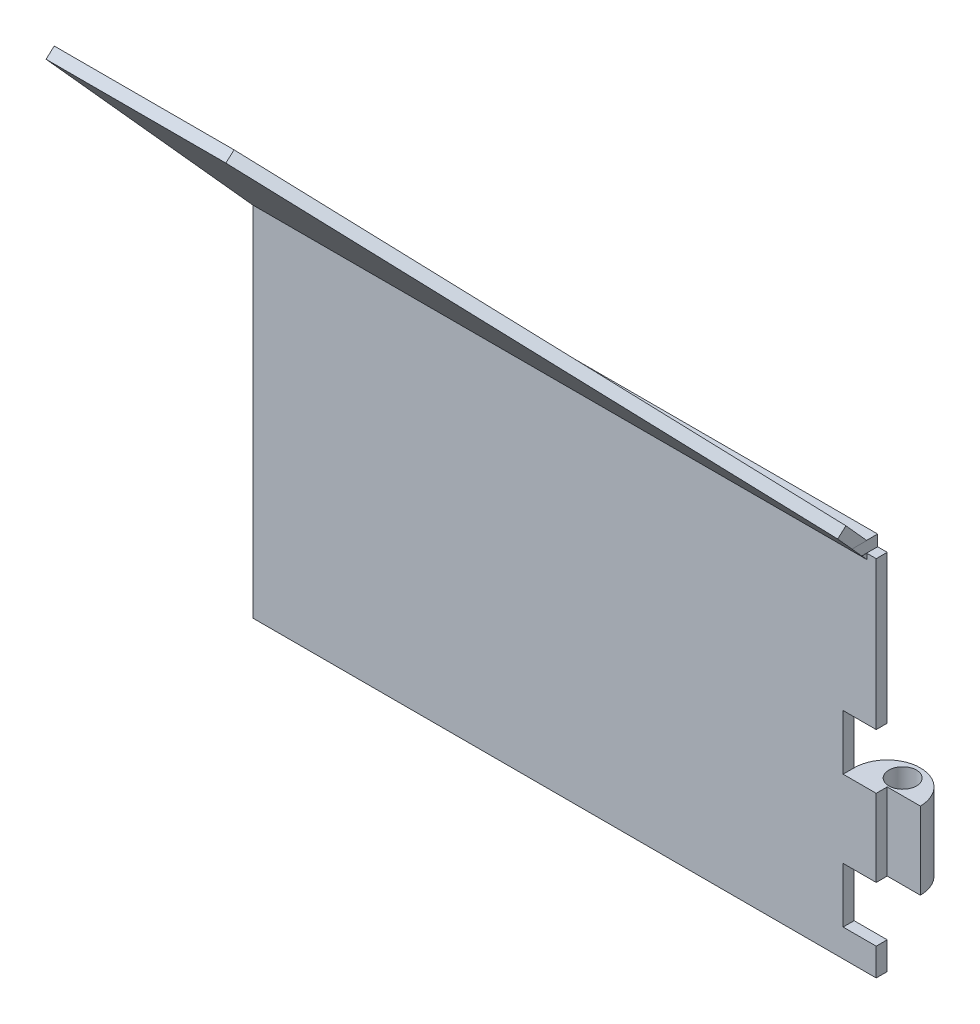
ISO-10303-21;
HEADER;
FILE_DESCRIPTION(('STEP AP214'),'2;1');
FILE_NAME('part.step','',(''),(''),'','','');
FILE_SCHEMA(('AUTOMOTIVE_DESIGN { 1 0 10303 214 1 1 1 1 }'));
ENDSEC;
DATA;
#1=APPLICATION_CONTEXT('core data for automotive mechanical design processes');
#2=APPLICATION_PROTOCOL_DEFINITION('international standard','automotive_design',2000,#1);
#3=PRODUCT_CONTEXT('',#1,'mechanical');
#4=PRODUCT('Part','Part','',(#3));
#5=PRODUCT_RELATED_PRODUCT_CATEGORY('part','',(#4));
#6=PRODUCT_DEFINITION_FORMATION('','',#4);
#7=PRODUCT_DEFINITION_CONTEXT('part definition',#1,'design');
#8=PRODUCT_DEFINITION('design','',#6,#7);
#9=PRODUCT_DEFINITION_SHAPE('','',#8);
#10=(LENGTH_UNIT() NAMED_UNIT(*) SI_UNIT(.MILLI.,.METRE.));
#11=(NAMED_UNIT(*) PLANE_ANGLE_UNIT() SI_UNIT($,.RADIAN.));
#12=(NAMED_UNIT(*) SI_UNIT($,.STERADIAN.) SOLID_ANGLE_UNIT());
#13=UNCERTAINTY_MEASURE_WITH_UNIT(LENGTH_MEASURE(1.E-05),#10,'distance_accuracy_value','');
#14=(GEOMETRIC_REPRESENTATION_CONTEXT(3) GLOBAL_UNCERTAINTY_ASSIGNED_CONTEXT((#13)) GLOBAL_UNIT_ASSIGNED_CONTEXT((#10,
#11,#12)) REPRESENTATION_CONTEXT('',''));
#15=CARTESIAN_POINT('',(0.,0.,0.));
#16=DIRECTION('',(0.,0.,1.));
#17=DIRECTION('',(1.,0.,0.));
#18=AXIS2_PLACEMENT_3D('',#15,#16,#17);
#19=CARTESIAN_POINT('',(0.,0.,1.));
#20=DIRECTION('',(0.,0.,1.));
#21=DIRECTION('',(1.,0.,0.));
#22=AXIS2_PLACEMENT_3D('',#19,#20,#21);
#23=PLANE('',#22);
#24=DIRECTION('',(0.,1.,0.));
#25=VECTOR('',#24,1.);
#26=CARTESIAN_POINT('',(28.25,2.53999999999999,1.));
#27=LINE('',#26,#25);
#28=CARTESIAN_POINT('',(28.25,2.53999999999999,1.));
#29=VERTEX_POINT('',#28);
#30=CARTESIAN_POINT('',(28.25,15.96,1.));
#31=VERTEX_POINT('',#30);
#32=EDGE_CURVE('E265',#29,#31,#27,.T.);
#33=ORIENTED_EDGE('',*,*,#32,.T.);
#34=DIRECTION('',(-1.,0.,0.));
#35=VECTOR('',#34,1.);
#36=CARTESIAN_POINT('',(0.,15.96,1.));
#37=LINE('',#36,#35);
#38=CARTESIAN_POINT('',(27.4,15.96,1.));
#39=VERTEX_POINT('',#38);
#40=EDGE_CURVE('E366',#31,#39,#37,.T.);
#41=ORIENTED_EDGE('',*,*,#40,.T.);
#42=DIRECTION('',(0.,-1.,0.));
#43=VECTOR('',#42,1.);
#44=CARTESIAN_POINT('',(27.4,0.,1.));
#45=LINE('',#44,#43);
#46=CARTESIAN_POINT('',(27.4,15.4655234501354,1.00000000000002));
#47=VERTEX_POINT('',#46);
#48=EDGE_CURVE('E335',#39,#47,#45,.T.);
#49=ORIENTED_EDGE('',*,*,#48,.T.);
#50=DIRECTION('',(-1.,0.,0.));
#51=VECTOR('',#50,1.);
#52=CARTESIAN_POINT('',(0.,15.4655234501354,1.));
#53=LINE('',#52,#51);
#54=CARTESIAN_POINT('',(-28.25,15.4655234501354,1.));
#55=VERTEX_POINT('',#54);
#56=EDGE_CURVE('E337',#47,#55,#53,.T.);
#57=ORIENTED_EDGE('',*,*,#56,.T.);
#58=DIRECTION('',(0.,1.,0.));
#59=VECTOR('',#58,1.);
#60=CARTESIAN_POINT('',(-28.25,-16.96,1.));
#61=LINE('',#60,#59);
#62=CARTESIAN_POINT('',(-28.25,-16.96,1.));
#63=VERTEX_POINT('',#62);
#64=EDGE_CURVE('E269',#63,#55,#61,.T.);
#65=ORIENTED_EDGE('',*,*,#64,.F.);
#66=DIRECTION('',(-1.,0.,0.));
#67=VECTOR('',#66,1.);
#68=CARTESIAN_POINT('',(28.25,-16.96,1.));
#69=LINE('',#68,#67);
#70=CARTESIAN_POINT('',(28.25,-16.96,1.));
#71=VERTEX_POINT('',#70);
#72=EDGE_CURVE('E272',#71,#63,#69,.T.);
#73=ORIENTED_EDGE('',*,*,#72,.F.);
#74=DIRECTION('',(0.,1.,0.));
#75=VECTOR('',#74,1.);
#76=CARTESIAN_POINT('',(28.25,-16.96,1.));
#77=LINE('',#76,#75);
#78=CARTESIAN_POINT('',(28.25,-14.46,1.));
#79=VERTEX_POINT('',#78);
#80=EDGE_CURVE('E275',#71,#79,#77,.T.);
#81=ORIENTED_EDGE('',*,*,#80,.T.);
#82=DIRECTION('',(-1.,0.,0.));
#83=VECTOR('',#82,1.);
#84=CARTESIAN_POINT('',(28.25,-14.46,1.));
#85=LINE('',#84,#83);
#86=CARTESIAN_POINT('',(25.25,-14.46,1.));
#87=VERTEX_POINT('',#86);
#88=EDGE_CURVE('E277',#79,#87,#85,.T.);
#89=ORIENTED_EDGE('',*,*,#88,.T.);
#90=DIRECTION('',(0.,1.,0.));
#91=VECTOR('',#90,1.);
#92=CARTESIAN_POINT('',(25.25,-14.46,1.));
#93=LINE('',#92,#91);
#94=CARTESIAN_POINT('',(25.25,-9.46,1.));
#95=VERTEX_POINT('',#94);
#96=EDGE_CURVE('E279',#87,#95,#93,.T.);
#97=ORIENTED_EDGE('',*,*,#96,.T.);
#98=DIRECTION('',(1.,0.,0.));
#99=VECTOR('',#98,1.);
#100=CARTESIAN_POINT('',(25.25,-9.46,1.));
#101=LINE('',#100,#99);
#102=CARTESIAN_POINT('',(28.25,-9.46000000000001,1.));
#103=VERTEX_POINT('',#102);
#104=EDGE_CURVE('E281',#95,#103,#101,.T.);
#105=ORIENTED_EDGE('',*,*,#104,.T.);
#106=DIRECTION('',(0.,1.,0.));
#107=VECTOR('',#106,1.);
#108=CARTESIAN_POINT('',(28.25,-9.46000000000001,1.));
#109=LINE('',#108,#107);
#110=CARTESIAN_POINT('',(28.25,-2.46000000000001,1.));
#111=VERTEX_POINT('',#110);
#112=EDGE_CURVE('E283',#103,#111,#109,.T.);
#113=ORIENTED_EDGE('',*,*,#112,.T.);
#114=DIRECTION('',(-1.,0.,0.));
#115=VECTOR('',#114,1.);
#116=CARTESIAN_POINT('',(28.25,-2.46000000000001,1.));
#117=LINE('',#116,#115);
#118=CARTESIAN_POINT('',(25.25,-2.46,1.));
#119=VERTEX_POINT('',#118);
#120=EDGE_CURVE('E285',#111,#119,#117,.T.);
#121=ORIENTED_EDGE('',*,*,#120,.T.);
#122=DIRECTION('',(0.,1.,0.));
#123=VECTOR('',#122,1.);
#124=CARTESIAN_POINT('',(25.25,-2.46,1.));
#125=LINE('',#124,#123);
#126=CARTESIAN_POINT('',(25.25,2.54,1.));
#127=VERTEX_POINT('',#126);
#128=EDGE_CURVE('E287',#119,#127,#125,.T.);
#129=ORIENTED_EDGE('',*,*,#128,.T.);
#130=DIRECTION('',(1.,0.,0.));
#131=VECTOR('',#130,1.);
#132=CARTESIAN_POINT('',(25.25,2.54,1.));
#133=LINE('',#132,#131);
#134=EDGE_CURVE('E262',#127,#29,#133,.T.);
#135=ORIENTED_EDGE('',*,*,#134,.T.);
#136=EDGE_LOOP('',(#33,#41,#49,#57,#65,#73,#81,#89,#97,#105,#113,#121,#129,#135));
#137=FACE_BOUND('',#136,.T.);
#138=ADVANCED_FACE('F35',(#137),#23,.T.);
#139=CARTESIAN_POINT('',(28.25,2.53999999999999,1.));
#140=DIRECTION('',(-1.,0.,0.));
#141=DIRECTION('',(0.,0.,1.));
#142=AXIS2_PLACEMENT_3D('',#139,#140,#141);
#143=PLANE('',#142);
#144=DIRECTION('',(0.,0.,-1.));
#145=VECTOR('',#144,1.);
#146=CARTESIAN_POINT('',(28.25,15.96,3.44997656798042));
#147=LINE('',#146,#145);
#148=CARTESIAN_POINT('',(28.25,15.96,0.));
#149=VERTEX_POINT('',#148);
#150=EDGE_CURVE('E380',#31,#149,#147,.T.);
#151=ORIENTED_EDGE('',*,*,#150,.F.);
#152=ORIENTED_EDGE('',*,*,#32,.F.);
#153=DIRECTION('',(0.,0.,-1.));
#154=VECTOR('',#153,1.);
#155=CARTESIAN_POINT('',(28.25,2.53999999999999,1.));
#156=LINE('',#155,#154);
#157=CARTESIAN_POINT('',(28.25,2.53999999999999,0.));
#158=VERTEX_POINT('',#157);
#159=EDGE_CURVE('E43',#29,#158,#156,.T.);
#160=ORIENTED_EDGE('',*,*,#159,.T.);
#161=DIRECTION('',(0.,1.,0.));
#162=VECTOR('',#161,1.);
#163=CARTESIAN_POINT('',(28.25,2.53999999999999,0.));
#164=LINE('',#163,#162);
#165=EDGE_CURVE('E228',#158,#149,#164,.T.);
#166=ORIENTED_EDGE('',*,*,#165,.T.);
#167=EDGE_LOOP('',(#151,#152,#160,#166));
#168=FACE_BOUND('',#167,.T.);
#169=ADVANCED_FACE('F395',(#168),#143,.F.);
#170=CARTESIAN_POINT('',(28.25,16.96,1.));
#171=DIRECTION('',(0.,-1.,0.));
#172=DIRECTION('',(0.,0.,-1.));
#173=AXIS2_PLACEMENT_3D('',#170,#171,#172);
#174=PLANE('',#173);
#175=DIRECTION('',(0.,0.,-1.));
#176=VECTOR('',#175,1.);
#177=CARTESIAN_POINT('',(27.38,16.96,3.44997656798042));
#178=LINE('',#177,#176);
#179=CARTESIAN_POINT('',(27.38,16.96,1.00000000000001));
#180=VERTEX_POINT('',#179);
#181=CARTESIAN_POINT('',(27.38,16.96,0.));
#182=VERTEX_POINT('',#181);
#183=EDGE_CURVE('E204',#180,#182,#178,.T.);
#184=ORIENTED_EDGE('',*,*,#183,.T.);
#185=DIRECTION('',(-1.,0.,0.));
#186=VECTOR('',#185,1.);
#187=CARTESIAN_POINT('',(28.25,16.96,0.));
#188=LINE('',#187,#186);
#189=CARTESIAN_POINT('',(-28.25,16.96,0.));
#190=VERTEX_POINT('',#189);
#191=EDGE_CURVE('E218',#182,#190,#188,.T.);
#192=ORIENTED_EDGE('',*,*,#191,.T.);
#193=DIRECTION('',(0.,0.,-1.));
#194=VECTOR('',#193,1.);
#195=CARTESIAN_POINT('',(-28.25,16.96,1.));
#196=LINE('',#195,#194);
#197=CARTESIAN_POINT('',(-28.25,16.96,1.));
#198=VERTEX_POINT('',#197);
#199=EDGE_CURVE('E397',#198,#190,#196,.T.);
#200=ORIENTED_EDGE('',*,*,#199,.F.);
#201=DIRECTION('',(1.,0.,0.));
#202=VECTOR('',#201,1.);
#203=CARTESIAN_POINT('',(-28.25,16.96,1.00000000000001));
#204=LINE('',#203,#202);
#205=EDGE_CURVE('E221',#198,#180,#204,.T.);
#206=ORIENTED_EDGE('',*,*,#205,.T.);
#207=EDGE_LOOP('',(#184,#192,#200,#206));
#208=FACE_BOUND('',#207,.T.);
#209=ADVANCED_FACE('F216',(#208),#174,.F.);
#210=CARTESIAN_POINT('',(0.,0.,0.));
#211=DIRECTION('',(0.,0.,1.));
#212=DIRECTION('',(1.,0.,0.));
#213=AXIS2_PLACEMENT_3D('',#210,#211,#212);
#214=PLANE('',#213);
#215=DIRECTION('',(1.,0.,0.));
#216=VECTOR('',#215,1.);
#217=CARTESIAN_POINT('',(28.25,15.96,0.));
#218=LINE('',#217,#216);
#219=CARTESIAN_POINT('',(27.38,15.96,0.));
#220=VERTEX_POINT('',#219);
#221=EDGE_CURVE('E212',#220,#149,#218,.T.);
#222=ORIENTED_EDGE('',*,*,#221,.T.);
#223=ORIENTED_EDGE('',*,*,#165,.F.);
#224=DIRECTION('',(1.,0.,0.));
#225=VECTOR('',#224,1.);
#226=CARTESIAN_POINT('',(25.25,2.54,0.));
#227=LINE('',#226,#225);
#228=CARTESIAN_POINT('',(25.25,2.54,0.));
#229=VERTEX_POINT('',#228);
#230=EDGE_CURVE('E233',#229,#158,#227,.T.);
#231=ORIENTED_EDGE('',*,*,#230,.F.);
#232=DIRECTION('',(0.,1.,0.));
#233=VECTOR('',#232,1.);
#234=CARTESIAN_POINT('',(25.25,-2.46,0.));
#235=LINE('',#234,#233);
#236=CARTESIAN_POINT('',(25.25,-2.46,0.));
#237=VERTEX_POINT('',#236);
#238=EDGE_CURVE('E266',#237,#229,#235,.T.);
#239=ORIENTED_EDGE('',*,*,#238,.F.);
#240=DIRECTION('',(0.,-1.,0.));
#241=VECTOR('',#240,1.);
#242=CARTESIAN_POINT('',(25.25,4.24820393249936,0.));
#243=LINE('',#242,#241);
#244=CARTESIAN_POINT('',(25.25,-9.45999999999997,0.));
#245=VERTEX_POINT('',#244);
#246=EDGE_CURVE('E318',#237,#245,#243,.T.);
#247=ORIENTED_EDGE('',*,*,#246,.T.);
#248=DIRECTION('',(0.,1.,0.));
#249=VECTOR('',#248,1.);
#250=CARTESIAN_POINT('',(25.25,-14.46,0.));
#251=LINE('',#250,#249);
#252=CARTESIAN_POINT('',(25.25,-14.46,0.));
#253=VERTEX_POINT('',#252);
#254=EDGE_CURVE('E428',#253,#245,#251,.T.);
#255=ORIENTED_EDGE('',*,*,#254,.F.);
#256=DIRECTION('',(-1.,0.,0.));
#257=VECTOR('',#256,1.);
#258=CARTESIAN_POINT('',(28.25,-14.46,0.));
#259=LINE('',#258,#257);
#260=CARTESIAN_POINT('',(28.25,-14.46,0.));
#261=VERTEX_POINT('',#260);
#262=EDGE_CURVE('E431',#261,#253,#259,.T.);
#263=ORIENTED_EDGE('',*,*,#262,.F.);
#264=DIRECTION('',(0.,1.,0.));
#265=VECTOR('',#264,1.);
#266=CARTESIAN_POINT('',(28.25,-16.96,0.));
#267=LINE('',#266,#265);
#268=CARTESIAN_POINT('',(28.25,-16.96,0.));
#269=VERTEX_POINT('',#268);
#270=EDGE_CURVE('E432',#269,#261,#267,.T.);
#271=ORIENTED_EDGE('',*,*,#270,.F.);
#272=DIRECTION('',(-1.,0.,0.));
#273=VECTOR('',#272,1.);
#274=CARTESIAN_POINT('',(28.25,-16.96,0.));
#275=LINE('',#274,#273);
#276=CARTESIAN_POINT('',(21.75,-16.96,0.));
#277=VERTEX_POINT('',#276);
#278=EDGE_CURVE('E230',#269,#277,#275,.T.);
#279=ORIENTED_EDGE('',*,*,#278,.T.);
#280=DIRECTION('',(0.,1.,0.));
#281=VECTOR('',#280,1.);
#282=CARTESIAN_POINT('',(21.75,-16.96,0.));
#283=LINE('',#282,#281);
#284=CARTESIAN_POINT('',(21.75,13.04,0.));
#285=VERTEX_POINT('',#284);
#286=EDGE_CURVE('E307',#277,#285,#283,.T.);
#287=ORIENTED_EDGE('',*,*,#286,.T.);
#288=DIRECTION('',(-1.,0.,0.));
#289=VECTOR('',#288,1.);
#290=CARTESIAN_POINT('',(21.75,13.04,0.));
#291=LINE('',#290,#289);
#292=CARTESIAN_POINT('',(-28.25,13.04,0.));
#293=VERTEX_POINT('',#292);
#294=EDGE_CURVE('E251',#285,#293,#291,.T.);
#295=ORIENTED_EDGE('',*,*,#294,.T.);
#296=DIRECTION('',(0.,1.,0.));
#297=VECTOR('',#296,1.);
#298=CARTESIAN_POINT('',(-28.25,-16.96,0.));
#299=LINE('',#298,#297);
#300=EDGE_CURVE('E226',#293,#190,#299,.T.);
#301=ORIENTED_EDGE('',*,*,#300,.T.);
#302=ORIENTED_EDGE('',*,*,#191,.F.);
#303=DIRECTION('',(0.,-1.,0.));
#304=VECTOR('',#303,1.);
#305=CARTESIAN_POINT('',(27.38,16.96,0.));
#306=LINE('',#305,#304);
#307=EDGE_CURVE('E201',#182,#220,#306,.T.);
#308=ORIENTED_EDGE('',*,*,#307,.T.);
#309=EDGE_LOOP('',(#222,#223,#231,#239,#247,#255,#263,#271,#279,#287,#295,#301,#302,#308));
#310=FACE_BOUND('',#309,.T.);
#311=ADVANCED_FACE('F223',(#310),#214,.F.);
#312=CARTESIAN_POINT('',(27.4,-36.1524105593163,-46.8226292700155));
#313=DIRECTION('',(-1.,0.,0.));
#314=DIRECTION('',(0.,-1.,0.));
#315=AXIS2_PLACEMENT_3D('',#312,#313,#314);
#316=PLANE('',#315);
#317=DIRECTION('',(0.,0.,-1.));
#318=VECTOR('',#317,1.);
#319=CARTESIAN_POINT('',(27.4,15.96,-46.8226292700155));
#320=LINE('',#319,#318);
#321=CARTESIAN_POINT('',(27.4,15.96,1.44522868530854));
#322=VERTEX_POINT('',#321);
#323=EDGE_CURVE('E373',#322,#39,#320,.T.);
#324=ORIENTED_EDGE('',*,*,#323,.F.);
#325=DIRECTION('',(0.,0.743144825477396,0.669130606358857));
#326=VECTOR('',#325,1.);
#327=CARTESIAN_POINT('',(27.4,-36.8215411656751,-46.0794844445381));
#328=LINE('',#327,#326);
#329=EDGE_CURVE('E340',#47,#322,#328,.T.);
#330=ORIENTED_EDGE('',*,*,#329,.F.);
#331=ORIENTED_EDGE('',*,*,#48,.F.);
#332=EDGE_LOOP('',(#324,#330,#331));
#333=FACE_BOUND('',#332,.T.);
#334=ADVANCED_FACE('F451',(#333),#316,.F.);
#335=DIRECTION('',(0.,0.,1.));
#336=VECTOR('',#335,1.);
#337=CARTESIAN_POINT('',(27.4,16.96,-46.8226292700155));
#338=LINE('',#337,#336);
#339=CARTESIAN_POINT('',(27.4,16.96,0.999999999999997));
#340=VERTEX_POINT('',#339);
#341=CARTESIAN_POINT('',(27.4,16.96,2.34563272960638));
#342=VERTEX_POINT('',#341);
#343=EDGE_CURVE('E375',#340,#342,#338,.T.);
#344=ORIENTED_EDGE('',*,*,#343,.F.);
#345=DIRECTION('',(0.,-0.743144825477395,-0.669130606358857));
#346=VECTOR('',#345,1.);
#347=CARTESIAN_POINT('',(27.4,19.0637459414868,2.89422135388983));
#348=LINE('',#347,#346);
#349=CARTESIAN_POINT('',(27.4,19.0637459414868,2.89422135388983));
#350=VERTEX_POINT('',#349);
#351=EDGE_CURVE('E353',#350,#340,#348,.T.);
#352=ORIENTED_EDGE('',*,*,#351,.F.);
#353=DIRECTION('',(0.,0.669130606358857,-0.743144825477395));
#354=VECTOR('',#353,1.);
#355=CARTESIAN_POINT('',(27.4,18.3946153351279,3.63736617936723));
#356=LINE('',#355,#354);
#357=CARTESIAN_POINT('',(27.4,18.3946153351279,3.63736617936723));
#358=VERTEX_POINT('',#357);
#359=EDGE_CURVE('E351',#358,#350,#356,.T.);
#360=ORIENTED_EDGE('',*,*,#359,.F.);
#361=EDGE_CURVE('E343',#342,#358,#328,.T.);
#362=ORIENTED_EDGE('',*,*,#361,.F.);
#363=EDGE_LOOP('',(#344,#352,#360,#362));
#364=FACE_BOUND('',#363,.T.);
#365=ADVANCED_FACE('F533',(#364),#316,.F.);
#366=CARTESIAN_POINT('',(27.4,-36.8215411656751,-46.0794844445381));
#367=DIRECTION('',(0.,0.669130606358857,-0.743144825477395));
#368=DIRECTION('',(0.,0.743144825477395,0.669130606358857));
#369=AXIS2_PLACEMENT_3D('',#366,#367,#368);
#370=PLANE('',#369);
#371=DIRECTION('',(1.,0.,0.));
#372=VECTOR('',#371,1.);
#373=CARTESIAN_POINT('',(27.4,15.96,1.44522868530853));
#374=LINE('',#373,#372);
#375=CARTESIAN_POINT('',(27.38,15.96,1.44522868530854));
#376=VERTEX_POINT('',#375);
#377=EDGE_CURVE('E11',#376,#322,#374,.T.);
#378=ORIENTED_EDGE('',*,*,#377,.F.);
#379=DIRECTION('',(0.,0.743144825477395,0.669130606358857));
#380=VECTOR('',#379,1.);
#381=CARTESIAN_POINT('',(27.38,17.509147063639,2.84008696662123));
#382=LINE('',#381,#380);
#383=CARTESIAN_POINT('',(27.38,16.96,2.34563272960638));
#384=VERTEX_POINT('',#383);
#385=EDGE_CURVE('E378',#376,#384,#382,.T.);
#386=ORIENTED_EDGE('',*,*,#385,.T.);
#387=DIRECTION('',(1.,0.,0.));
#388=VECTOR('',#387,1.);
#389=CARTESIAN_POINT('',(28.25,16.96,2.34563272960638));
#390=LINE('',#389,#388);
#391=EDGE_CURVE('E376',#384,#342,#390,.T.);
#392=ORIENTED_EDGE('',*,*,#391,.T.);
#393=ORIENTED_EDGE('',*,*,#361,.T.);
#394=DIRECTION('',(0.852965542672275,-0.387897241643859,-0.349264245148106));
#395=VECTOR('',#394,1.);
#396=CARTESIAN_POINT('',(-11.95,36.2895427326236,19.7500311804885));
#397=LINE('',#396,#395);
#398=CARTESIAN_POINT('',(-11.95,36.2895427326236,19.7500311804885));
#399=VERTEX_POINT('',#398);
#400=EDGE_CURVE('E349',#399,#358,#397,.T.);
#401=ORIENTED_EDGE('',*,*,#400,.F.);
#402=DIRECTION('',(1.,0.,0.));
#403=VECTOR('',#402,1.);
#404=CARTESIAN_POINT('',(-28.25,36.2895427326236,19.7500311804885));
#405=LINE('',#404,#403);
#406=CARTESIAN_POINT('',(-28.25,36.2895427326236,19.7500311804885));
#407=VERTEX_POINT('',#406);
#408=EDGE_CURVE('E356',#407,#399,#405,.T.);
#409=ORIENTED_EDGE('',*,*,#408,.F.);
#410=DIRECTION('',(0.,0.743144825477396,0.669130606358857));
#411=VECTOR('',#410,1.);
#412=CARTESIAN_POINT('',(-28.25,-36.8215411656751,-46.0794844445381));
#413=LINE('',#412,#411);
#414=EDGE_CURVE('E58',#55,#407,#413,.T.);
#415=ORIENTED_EDGE('',*,*,#414,.F.);
#416=ORIENTED_EDGE('',*,*,#56,.F.);
#417=ORIENTED_EDGE('',*,*,#329,.T.);
#418=EDGE_LOOP('',(#378,#386,#392,#393,#401,#409,#415,#416,#417));
#419=FACE_BOUND('',#418,.T.);
#420=ADVANCED_FACE('F387',(#419),#370,.F.);
#421=CARTESIAN_POINT('',(25.25,2.54,1.));
#422=DIRECTION('',(0.,1.,0.));
#423=DIRECTION('',(-1.,0.,0.));
#424=AXIS2_PLACEMENT_3D('',#421,#422,#423);
#425=PLANE('',#424);
#426=ORIENTED_EDGE('',*,*,#230,.T.);
#427=ORIENTED_EDGE('',*,*,#159,.F.);
#428=ORIENTED_EDGE('',*,*,#134,.F.);
#429=DIRECTION('',(0.,0.,-1.));
#430=VECTOR('',#429,1.);
#431=CARTESIAN_POINT('',(25.25,2.54,1.));
#432=LINE('',#431,#430);
#433=EDGE_CURVE('E288',#127,#229,#432,.T.);
#434=ORIENTED_EDGE('',*,*,#433,.T.);
#435=EDGE_LOOP('',(#426,#427,#428,#434));
#436=FACE_BOUND('',#435,.T.);
#437=ADVANCED_FACE('F37',(#436),#425,.F.);
#438=CARTESIAN_POINT('',(-28.25,-16.96,1.));
#439=DIRECTION('',(-1.,0.,0.));
#440=DIRECTION('',(0.,0.,1.));
#441=AXIS2_PLACEMENT_3D('',#438,#439,#440);
#442=PLANE('',#441);
#443=ORIENTED_EDGE('',*,*,#414,.T.);
#444=DIRECTION('',(0.,0.669130606358857,-0.743144825477395));
#445=VECTOR('',#444,1.);
#446=CARTESIAN_POINT('',(-28.25,36.2895427326236,19.7500311804885));
#447=LINE('',#446,#445);
#448=CARTESIAN_POINT('',(-28.25,36.9586733389824,19.0068863550111));
#449=VERTEX_POINT('',#448);
#450=EDGE_CURVE('E346',#407,#449,#447,.T.);
#451=ORIENTED_EDGE('',*,*,#450,.T.);
#452=DIRECTION('',(0.,0.743144825477395,0.669130606358857));
#453=VECTOR('',#452,1.);
#454=CARTESIAN_POINT('',(-28.25,16.96,1.));
#455=LINE('',#454,#453);
#456=EDGE_CURVE('E363',#198,#449,#455,.T.);
#457=ORIENTED_EDGE('',*,*,#456,.F.);
#458=ORIENTED_EDGE('',*,*,#199,.T.);
#459=ORIENTED_EDGE('',*,*,#300,.F.);
#460=DIRECTION('',(0.,-0.707106781186554,-0.707106781186541));
#461=VECTOR('',#460,1.);
#462=CARTESIAN_POINT('',(-28.25,13.04,0.));
#463=LINE('',#462,#461);
#464=CARTESIAN_POINT('',(-28.25,10.54,-2.5));
#465=VERTEX_POINT('',#464);
#466=EDGE_CURVE('E244',#293,#465,#463,.T.);
#467=ORIENTED_EDGE('',*,*,#466,.T.);
#468=DIRECTION('',(0.,-1.,0.));
#469=VECTOR('',#468,1.);
#470=CARTESIAN_POINT('',(-28.25,10.54,-2.5));
#471=LINE('',#470,#469);
#472=CARTESIAN_POINT('',(-28.25,-14.4600000000001,-2.5));
#473=VERTEX_POINT('',#472);
#474=EDGE_CURVE('E247',#465,#473,#471,.T.);
#475=ORIENTED_EDGE('',*,*,#474,.T.);
#476=DIRECTION('',(0.,-0.707106781186542,0.707106781186553));
#477=VECTOR('',#476,1.);
#478=CARTESIAN_POINT('',(-28.25,-14.4600000000001,-2.5));
#479=LINE('',#478,#477);
#480=CARTESIAN_POINT('',(-28.25,-16.96,0.));
#481=VERTEX_POINT('',#480);
#482=EDGE_CURVE('E305',#473,#481,#479,.T.);
#483=ORIENTED_EDGE('',*,*,#482,.T.);
#484=DIRECTION('',(0.,0.,-1.));
#485=VECTOR('',#484,1.);
#486=CARTESIAN_POINT('',(-28.25,-16.96,1.));
#487=LINE('',#486,#485);
#488=EDGE_CURVE('E398',#63,#481,#487,.T.);
#489=ORIENTED_EDGE('',*,*,#488,.F.);
#490=ORIENTED_EDGE('',*,*,#64,.T.);
#491=EDGE_LOOP('',(#443,#451,#457,#458,#459,#467,#475,#483,#489,#490));
#492=FACE_BOUND('',#491,.T.);
#493=ADVANCED_FACE('F446',(#492),#442,.T.);
#494=CARTESIAN_POINT('',(28.25,-16.96,1.));
#495=DIRECTION('',(0.,-1.,0.));
#496=DIRECTION('',(0.,0.,-1.));
#497=AXIS2_PLACEMENT_3D('',#494,#495,#496);
#498=PLANE('',#497);
#499=ORIENTED_EDGE('',*,*,#278,.F.);
#500=DIRECTION('',(0.,0.,-1.));
#501=VECTOR('',#500,1.);
#502=CARTESIAN_POINT('',(28.25,-16.96,1.));
#503=LINE('',#502,#501);
#504=EDGE_CURVE('E403',#71,#269,#503,.T.);
#505=ORIENTED_EDGE('',*,*,#504,.F.);
#506=ORIENTED_EDGE('',*,*,#72,.T.);
#507=ORIENTED_EDGE('',*,*,#488,.T.);
#508=DIRECTION('',(-1.,0.,0.));
#509=VECTOR('',#508,1.);
#510=CARTESIAN_POINT('',(21.75,-16.96,0.));
#511=LINE('',#510,#509);
#512=EDGE_CURVE('E256',#277,#481,#511,.T.);
#513=ORIENTED_EDGE('',*,*,#512,.F.);
#514=EDGE_LOOP('',(#499,#505,#506,#507,#513));
#515=FACE_BOUND('',#514,.T.);
#516=ADVANCED_FACE('F441',(#515),#498,.T.);
#517=CARTESIAN_POINT('',(28.25,-16.96,1.));
#518=DIRECTION('',(-1.,0.,0.));
#519=DIRECTION('',(0.,0.,1.));
#520=AXIS2_PLACEMENT_3D('',#517,#518,#519);
#521=PLANE('',#520);
#522=ORIENTED_EDGE('',*,*,#270,.T.);
#523=DIRECTION('',(0.,0.,-1.));
#524=VECTOR('',#523,1.);
#525=CARTESIAN_POINT('',(28.25,-14.46,1.));
#526=LINE('',#525,#524);
#527=EDGE_CURVE('E405',#79,#261,#526,.T.);
#528=ORIENTED_EDGE('',*,*,#527,.F.);
#529=ORIENTED_EDGE('',*,*,#80,.F.);
#530=ORIENTED_EDGE('',*,*,#504,.T.);
#531=EDGE_LOOP('',(#522,#528,#529,#530));
#532=FACE_BOUND('',#531,.T.);
#533=ADVANCED_FACE('F481',(#532),#521,.F.);
#534=CARTESIAN_POINT('',(28.25,-14.46,1.));
#535=DIRECTION('',(0.,-1.,0.));
#536=DIRECTION('',(0.,0.,-1.));
#537=AXIS2_PLACEMENT_3D('',#534,#535,#536);
#538=PLANE('',#537);
#539=ORIENTED_EDGE('',*,*,#262,.T.);
#540=DIRECTION('',(0.,0.,-1.));
#541=VECTOR('',#540,1.);
#542=CARTESIAN_POINT('',(25.25,-14.46,1.));
#543=LINE('',#542,#541);
#544=EDGE_CURVE('E408',#87,#253,#543,.T.);
#545=ORIENTED_EDGE('',*,*,#544,.F.);
#546=ORIENTED_EDGE('',*,*,#88,.F.);
#547=ORIENTED_EDGE('',*,*,#527,.T.);
#548=EDGE_LOOP('',(#539,#545,#546,#547));
#549=FACE_BOUND('',#548,.T.);
#550=ADVANCED_FACE('F479',(#549),#538,.F.);
#551=CARTESIAN_POINT('',(25.25,-14.46,1.));
#552=DIRECTION('',(-1.,0.,0.));
#553=DIRECTION('',(0.,0.,1.));
#554=AXIS2_PLACEMENT_3D('',#551,#552,#553);
#555=PLANE('',#554);
#556=ORIENTED_EDGE('',*,*,#254,.T.);
#557=DIRECTION('',(0.,0.,-1.));
#558=VECTOR('',#557,1.);
#559=CARTESIAN_POINT('',(25.25,-9.46,1.));
#560=LINE('',#559,#558);
#561=EDGE_CURVE('E411',#95,#245,#560,.T.);
#562=ORIENTED_EDGE('',*,*,#561,.F.);
#563=ORIENTED_EDGE('',*,*,#96,.F.);
#564=ORIENTED_EDGE('',*,*,#544,.T.);
#565=EDGE_LOOP('',(#556,#562,#563,#564));
#566=FACE_BOUND('',#565,.T.);
#567=ADVANCED_FACE('F476',(#566),#555,.F.);
#568=CARTESIAN_POINT('',(25.25,-9.46,1.));
#569=DIRECTION('',(0.,1.,0.));
#570=DIRECTION('',(-1.,0.,0.));
#571=AXIS2_PLACEMENT_3D('',#568,#569,#570);
#572=PLANE('',#571);
#573=CARTESIAN_POINT('',(28.25,-9.46000000000001,-1.4));
#574=DIRECTION('',(0.,1.,0.));
#575=DIRECTION('',(-1.,0.,0.));
#576=AXIS2_PLACEMENT_3D('',#573,#574,#575);
#577=CIRCLE('',#576,1.25);
#578=CARTESIAN_POINT('',(27.,-9.46,-1.4));
#579=VERTEX_POINT('',#578);
#580=EDGE_CURVE('E327',#579,#579,#577,.F.);
#581=ORIENTED_EDGE('',*,*,#580,.F.);
#582=EDGE_LOOP('',(#581));
#583=FACE_BOUND('',#582,.T.);
#584=ORIENTED_EDGE('',*,*,#561,.T.);
#585=CARTESIAN_POINT('',(28.25,-9.45999999999997,0.));
#586=DIRECTION('',(0.,-1.,0.));
#587=DIRECTION('',(0.,0.,-1.));
#588=AXIS2_PLACEMENT_3D('',#585,#586,#587);
#589=CIRCLE('',#588,3.);
#590=CARTESIAN_POINT('',(31.25,-9.45999999999997,0.));
#591=VERTEX_POINT('',#590);
#592=EDGE_CURVE('E324',#245,#591,#589,.T.);
#593=ORIENTED_EDGE('',*,*,#592,.T.);
#594=DIRECTION('',(-1.,0.,0.));
#595=VECTOR('',#594,1.);
#596=CARTESIAN_POINT('',(25.25,-9.45999999999997,0.));
#597=LINE('',#596,#595);
#598=CARTESIAN_POINT('',(28.25,-9.45999999999997,0.));
#599=VERTEX_POINT('',#598);
#600=EDGE_CURVE('E319',#591,#599,#597,.T.);
#601=ORIENTED_EDGE('',*,*,#600,.T.);
#602=DIRECTION('',(0.,0.,-1.));
#603=VECTOR('',#602,1.);
#604=CARTESIAN_POINT('',(28.25,-9.46000000000001,1.));
#605=LINE('',#604,#603);
#606=EDGE_CURVE('E414',#103,#599,#605,.T.);
#607=ORIENTED_EDGE('',*,*,#606,.F.);
#608=ORIENTED_EDGE('',*,*,#104,.F.);
#609=EDGE_LOOP('',(#584,#593,#601,#607,#608));
#610=FACE_BOUND('',#609,.T.);
#611=ADVANCED_FACE('F471',(#583,#610),#572,.F.);
#612=CARTESIAN_POINT('',(28.25,-9.46000000000001,1.));
#613=DIRECTION('',(-1.,0.,0.));
#614=DIRECTION('',(0.,-1.,0.));
#615=AXIS2_PLACEMENT_3D('',#612,#613,#614);
#616=PLANE('',#615);
#617=DIRECTION('',(0.,1.,0.));
#618=VECTOR('',#617,1.);
#619=CARTESIAN_POINT('',(28.25,-9.46000000000001,0.));
#620=LINE('',#619,#618);
#621=CARTESIAN_POINT('',(28.25,-2.46000000000001,0.));
#622=VERTEX_POINT('',#621);
#623=EDGE_CURVE('E425',#599,#622,#620,.T.);
#624=ORIENTED_EDGE('',*,*,#623,.T.);
#625=DIRECTION('',(0.,0.,-1.));
#626=VECTOR('',#625,1.);
#627=CARTESIAN_POINT('',(28.25,-2.46000000000001,1.));
#628=LINE('',#627,#626);
#629=EDGE_CURVE('E417',#111,#622,#628,.T.);
#630=ORIENTED_EDGE('',*,*,#629,.F.);
#631=ORIENTED_EDGE('',*,*,#112,.F.);
#632=ORIENTED_EDGE('',*,*,#606,.T.);
#633=EDGE_LOOP('',(#624,#630,#631,#632));
#634=FACE_BOUND('',#633,.T.);
#635=ADVANCED_FACE('F485',(#634),#616,.F.);
#636=CARTESIAN_POINT('',(28.25,-2.46000000000001,1.));
#637=DIRECTION('',(0.,-1.,0.));
#638=DIRECTION('',(1.,0.,0.));
#639=AXIS2_PLACEMENT_3D('',#636,#637,#638);
#640=PLANE('',#639);
#641=CARTESIAN_POINT('',(28.25,-2.45999999999998,-1.4));
#642=DIRECTION('',(0.,1.,0.));
#643=DIRECTION('',(0.,0.,1.));
#644=AXIS2_PLACEMENT_3D('',#641,#642,#643);
#645=CIRCLE('',#644,1.25);
#646=CARTESIAN_POINT('',(28.25,-2.45999999999998,-0.149999999999999));
#647=VERTEX_POINT('',#646);
#648=EDGE_CURVE('E332',#647,#647,#645,.T.);
#649=ORIENTED_EDGE('',*,*,#648,.F.);
#650=EDGE_LOOP('',(#649));
#651=FACE_BOUND('',#650,.T.);
#652=ORIENTED_EDGE('',*,*,#629,.T.);
#653=DIRECTION('',(1.,0.,0.));
#654=VECTOR('',#653,1.);
#655=CARTESIAN_POINT('',(25.25,-2.46,0.));
#656=LINE('',#655,#654);
#657=CARTESIAN_POINT('',(31.25,-2.46000000000001,0.));
#658=VERTEX_POINT('',#657);
#659=EDGE_CURVE('E248',#622,#658,#656,.T.);
#660=ORIENTED_EDGE('',*,*,#659,.T.);
#661=CARTESIAN_POINT('',(28.25,-2.46000000000001,0.));
#662=DIRECTION('',(0.,-1.,0.));
#663=DIRECTION('',(1.,0.,0.));
#664=AXIS2_PLACEMENT_3D('',#661,#662,#663);
#665=CIRCLE('',#664,3.);
#666=EDGE_CURVE('E315',#658,#237,#665,.F.);
#667=ORIENTED_EDGE('',*,*,#666,.T.);
#668=DIRECTION('',(0.,0.,-1.));
#669=VECTOR('',#668,1.);
#670=CARTESIAN_POINT('',(25.25,-2.46,1.));
#671=LINE('',#670,#669);
#672=EDGE_CURVE('E420',#119,#237,#671,.T.);
#673=ORIENTED_EDGE('',*,*,#672,.F.);
#674=ORIENTED_EDGE('',*,*,#120,.F.);
#675=EDGE_LOOP('',(#652,#660,#667,#673,#674));
#676=FACE_BOUND('',#675,.T.);
#677=ADVANCED_FACE('F461',(#651,#676),#640,.F.);
#678=CARTESIAN_POINT('',(25.25,-2.46,1.));
#679=DIRECTION('',(-1.,0.,0.));
#680=DIRECTION('',(0.,0.,1.));
#681=AXIS2_PLACEMENT_3D('',#678,#679,#680);
#682=PLANE('',#681);
#683=ORIENTED_EDGE('',*,*,#238,.T.);
#684=ORIENTED_EDGE('',*,*,#433,.F.);
#685=ORIENTED_EDGE('',*,*,#128,.F.);
#686=ORIENTED_EDGE('',*,*,#672,.T.);
#687=EDGE_LOOP('',(#683,#684,#685,#686));
#688=FACE_BOUND('',#687,.T.);
#689=ADVANCED_FACE('F457',(#688),#682,.F.);
#690=CARTESIAN_POINT('',(21.75,-14.4600000000001,-2.5));
#691=DIRECTION('',(0.,-0.707106781186553,-0.707106781186542));
#692=DIRECTION('',(0.,0.707106781186542,-0.707106781186553));
#693=AXIS2_PLACEMENT_3D('',#690,#691,#692);
#694=PLANE('',#693);
#695=ORIENTED_EDGE('',*,*,#482,.F.);
#696=DIRECTION('',(-1.,0.,0.));
#697=VECTOR('',#696,1.);
#698=CARTESIAN_POINT('',(21.75,-14.4600000000001,-2.5));
#699=LINE('',#698,#697);
#700=CARTESIAN_POINT('',(21.75,-14.4600000000001,-2.5));
#701=VERTEX_POINT('',#700);
#702=EDGE_CURVE('E294',#701,#473,#699,.T.);
#703=ORIENTED_EDGE('',*,*,#702,.F.);
#704=DIRECTION('',(0.,-0.707106781186542,0.707106781186553));
#705=VECTOR('',#704,1.);
#706=CARTESIAN_POINT('',(21.75,-14.4600000000001,-2.5));
#707=LINE('',#706,#705);
#708=EDGE_CURVE('E255',#701,#277,#707,.T.);
#709=ORIENTED_EDGE('',*,*,#708,.T.);
#710=ORIENTED_EDGE('',*,*,#512,.T.);
#711=EDGE_LOOP('',(#695,#703,#709,#710));
#712=FACE_BOUND('',#711,.T.);
#713=ADVANCED_FACE('F508',(#712),#694,.T.);
#714=CARTESIAN_POINT('',(21.75,10.54,-2.5));
#715=DIRECTION('',(0.,0.,-1.));
#716=DIRECTION('',(0.,1.,0.));
#717=AXIS2_PLACEMENT_3D('',#714,#715,#716);
#718=PLANE('',#717);
#719=ORIENTED_EDGE('',*,*,#474,.F.);
#720=DIRECTION('',(-1.,0.,0.));
#721=VECTOR('',#720,1.);
#722=CARTESIAN_POINT('',(21.75,10.54,-2.5));
#723=LINE('',#722,#721);
#724=CARTESIAN_POINT('',(21.75,10.54,-2.5));
#725=VERTEX_POINT('',#724);
#726=EDGE_CURVE('E254',#725,#465,#723,.T.);
#727=ORIENTED_EDGE('',*,*,#726,.F.);
#728=DIRECTION('',(0.,-1.,0.));
#729=VECTOR('',#728,1.);
#730=CARTESIAN_POINT('',(21.75,10.54,-2.5));
#731=LINE('',#730,#729);
#732=EDGE_CURVE('E309',#725,#701,#731,.T.);
#733=ORIENTED_EDGE('',*,*,#732,.T.);
#734=ORIENTED_EDGE('',*,*,#702,.T.);
#735=EDGE_LOOP('',(#719,#727,#733,#734));
#736=FACE_BOUND('',#735,.T.);
#737=ADVANCED_FACE('F512',(#736),#718,.T.);
#738=CARTESIAN_POINT('',(21.75,13.04,0.));
#739=DIRECTION('',(0.,0.707106781186541,-0.707106781186554));
#740=DIRECTION('',(0.,0.707106781186554,0.707106781186541));
#741=AXIS2_PLACEMENT_3D('',#738,#739,#740);
#742=PLANE('',#741);
#743=ORIENTED_EDGE('',*,*,#466,.F.);
#744=ORIENTED_EDGE('',*,*,#294,.F.);
#745=DIRECTION('',(0.,-0.707106781186554,-0.707106781186541));
#746=VECTOR('',#745,1.);
#747=CARTESIAN_POINT('',(21.75,13.04,0.));
#748=LINE('',#747,#746);
#749=EDGE_CURVE('E311',#285,#725,#748,.T.);
#750=ORIENTED_EDGE('',*,*,#749,.T.);
#751=ORIENTED_EDGE('',*,*,#726,.T.);
#752=EDGE_LOOP('',(#743,#744,#750,#751));
#753=FACE_BOUND('',#752,.T.);
#754=ADVANCED_FACE('F503',(#753),#742,.T.);
#755=CARTESIAN_POINT('',(21.75,0.,0.));
#756=DIRECTION('',(-1.,0.,0.));
#757=DIRECTION('',(0.,0.,1.));
#758=AXIS2_PLACEMENT_3D('',#755,#756,#757);
#759=PLANE('',#758);
#760=ORIENTED_EDGE('',*,*,#286,.F.);
#761=ORIENTED_EDGE('',*,*,#708,.F.);
#762=ORIENTED_EDGE('',*,*,#732,.F.);
#763=ORIENTED_EDGE('',*,*,#749,.F.);
#764=EDGE_LOOP('',(#760,#761,#762,#763));
#765=FACE_BOUND('',#764,.T.);
#766=ADVANCED_FACE('F518',(#765),#759,.F.);
#767=CARTESIAN_POINT('',(25.25,4.24820393249936,0.));
#768=DIRECTION('',(0.,0.,1.));
#769=DIRECTION('',(1.,0.,0.));
#770=AXIS2_PLACEMENT_3D('',#767,#768,#769);
#771=PLANE('',#770);
#772=ORIENTED_EDGE('',*,*,#623,.F.);
#773=ORIENTED_EDGE('',*,*,#600,.F.);
#774=DIRECTION('',(0.,-1.,0.));
#775=VECTOR('',#774,1.);
#776=CARTESIAN_POINT('',(31.25,4.24820393249936,0.));
#777=LINE('',#776,#775);
#778=EDGE_CURVE('E316',#658,#591,#777,.T.);
#779=ORIENTED_EDGE('',*,*,#778,.F.);
#780=ORIENTED_EDGE('',*,*,#659,.F.);
#781=EDGE_LOOP('',(#772,#773,#779,#780));
#782=FACE_BOUND('',#781,.T.);
#783=ADVANCED_FACE('F468',(#782),#771,.T.);
#784=CARTESIAN_POINT('',(28.25,4.24820393249936,0.));
#785=DIRECTION('',(0.,-1.,0.));
#786=DIRECTION('',(0.,0.,-1.));
#787=AXIS2_PLACEMENT_3D('',#784,#785,#786);
#788=CYLINDRICAL_SURFACE('',#787,3.);
#789=ORIENTED_EDGE('',*,*,#666,.F.);
#790=ORIENTED_EDGE('',*,*,#778,.T.);
#791=ORIENTED_EDGE('',*,*,#592,.F.);
#792=ORIENTED_EDGE('',*,*,#246,.F.);
#793=EDGE_LOOP('',(#789,#790,#791,#792));
#794=FACE_BOUND('',#793,.T.);
#795=ADVANCED_FACE('F465',(#794),#788,.T.);
#796=CARTESIAN_POINT('',(28.25,-12.9955339059327,-1.4));
#797=DIRECTION('',(0.,1.,0.));
#798=DIRECTION('',(0.,0.,1.));
#799=AXIS2_PLACEMENT_3D('',#796,#797,#798);
#800=CYLINDRICAL_SURFACE('',#799,1.25);
#801=ORIENTED_EDGE('',*,*,#580,.T.);
#802=EDGE_LOOP('',(#801));
#803=FACE_BOUND('',#802,.T.);
#804=ORIENTED_EDGE('',*,*,#648,.T.);
#805=EDGE_LOOP('',(#804));
#806=FACE_BOUND('',#805,.T.);
#807=ADVANCED_FACE('F524',(#803,#806),#800,.F.);
#808=CARTESIAN_POINT('',(-11.95,36.2895427326236,19.7500311804885));
#809=DIRECTION('',(0.52196722408001,0.63387692934742,0.570745350771511));
#810=DIRECTION('',(0.,-0.669130606358857,0.743144825477396));
#811=AXIS2_PLACEMENT_3D('',#808,#809,#810);
#812=PLANE('',#811);
#813=DIRECTION('',(0.852965542672275,-0.387897241643859,-0.349264245148106));
#814=VECTOR('',#813,1.);
#815=CARTESIAN_POINT('',(-11.95,36.9586733389824,19.0068863550111));
#816=LINE('',#815,#814);
#817=CARTESIAN_POINT('',(-11.95,36.9586733389824,19.0068863550111));
#818=VERTEX_POINT('',#817);
#819=EDGE_CURVE('E357',#818,#350,#816,.T.);
#820=ORIENTED_EDGE('',*,*,#819,.F.);
#821=DIRECTION('',(0.,0.669130606358857,-0.743144825477395));
#822=VECTOR('',#821,1.);
#823=CARTESIAN_POINT('',(-11.95,36.2895427326236,19.7500311804885));
#824=LINE('',#823,#822);
#825=EDGE_CURVE('E348',#399,#818,#824,.T.);
#826=ORIENTED_EDGE('',*,*,#825,.F.);
#827=ORIENTED_EDGE('',*,*,#400,.T.);
#828=ORIENTED_EDGE('',*,*,#359,.T.);
#829=EDGE_LOOP('',(#820,#826,#827,#828));
#830=FACE_BOUND('',#829,.T.);
#831=ADVANCED_FACE('F529',(#830),#812,.T.);
#832=CARTESIAN_POINT('',(-28.25,36.2895427326236,19.7500311804885));
#833=DIRECTION('',(0.,0.743144825477395,0.669130606358857));
#834=DIRECTION('',(0.,-0.669130606358857,0.743144825477395));
#835=AXIS2_PLACEMENT_3D('',#832,#833,#834);
#836=PLANE('',#835);
#837=DIRECTION('',(1.,0.,0.));
#838=VECTOR('',#837,1.);
#839=CARTESIAN_POINT('',(-28.25,36.9586733389824,19.0068863550111));
#840=LINE('',#839,#838);
#841=EDGE_CURVE('E360',#449,#818,#840,.T.);
#842=ORIENTED_EDGE('',*,*,#841,.F.);
#843=ORIENTED_EDGE('',*,*,#450,.F.);
#844=ORIENTED_EDGE('',*,*,#408,.T.);
#845=ORIENTED_EDGE('',*,*,#825,.T.);
#846=EDGE_LOOP('',(#842,#843,#844,#845));
#847=FACE_BOUND('',#846,.T.);
#848=ADVANCED_FACE('F536',(#847),#836,.T.);
#849=CARTESIAN_POINT('',(0.,7.09633768380614,-7.88128144108913));
#850=DIRECTION('',(0.,0.669130606358857,-0.743144825477395));
#851=DIRECTION('',(0.,0.743144825477395,0.669130606358857));
#852=AXIS2_PLACEMENT_3D('',#849,#850,#851);
#853=PLANE('',#852);
#854=ORIENTED_EDGE('',*,*,#205,.F.);
#855=ORIENTED_EDGE('',*,*,#456,.T.);
#856=ORIENTED_EDGE('',*,*,#841,.T.);
#857=ORIENTED_EDGE('',*,*,#819,.T.);
#858=ORIENTED_EDGE('',*,*,#351,.T.);
#859=EDGE_CURVE('E345',#180,#340,#204,.T.);
#860=ORIENTED_EDGE('',*,*,#859,.F.);
#861=EDGE_LOOP('',(#854,#855,#856,#857,#858,#860));
#862=FACE_BOUND('',#861,.T.);
#863=ADVANCED_FACE('F539',(#862),#853,.T.);
#864=CARTESIAN_POINT('',(28.25,16.96,3.44997656798042));
#865=DIRECTION('',(0.,-1.,0.));
#866=DIRECTION('',(0.,0.,-1.));
#867=AXIS2_PLACEMENT_3D('',#864,#865,#866);
#868=PLANE('',#867);
#869=ORIENTED_EDGE('',*,*,#343,.T.);
#870=ORIENTED_EDGE('',*,*,#391,.F.);
#871=EDGE_CURVE('E50',#384,#180,#178,.T.);
#872=ORIENTED_EDGE('',*,*,#871,.T.);
#873=ORIENTED_EDGE('',*,*,#859,.T.);
#874=EDGE_LOOP('',(#869,#870,#872,#873));
#875=FACE_BOUND('',#874,.T.);
#876=ADVANCED_FACE('F546',(#875),#868,.T.);
#877=CARTESIAN_POINT('',(28.25,15.96,3.44997656798042));
#878=DIRECTION('',(0.,1.,0.));
#879=DIRECTION('',(0.,0.,1.));
#880=AXIS2_PLACEMENT_3D('',#877,#878,#879);
#881=PLANE('',#880);
#882=ORIENTED_EDGE('',*,*,#150,.T.);
#883=ORIENTED_EDGE('',*,*,#221,.F.);
#884=DIRECTION('',(0.,0.,-1.));
#885=VECTOR('',#884,1.);
#886=CARTESIAN_POINT('',(27.38,15.96,3.44997656798042));
#887=LINE('',#886,#885);
#888=EDGE_CURVE('E207',#376,#220,#887,.T.);
#889=ORIENTED_EDGE('',*,*,#888,.F.);
#890=ORIENTED_EDGE('',*,*,#377,.T.);
#891=ORIENTED_EDGE('',*,*,#323,.T.);
#892=ORIENTED_EDGE('',*,*,#40,.F.);
#893=EDGE_LOOP('',(#882,#883,#889,#890,#891,#892));
#894=FACE_BOUND('',#893,.T.);
#895=ADVANCED_FACE('F390',(#894),#881,.T.);
#896=CARTESIAN_POINT('',(27.38,16.96,3.44997656798042));
#897=DIRECTION('',(1.,0.,0.));
#898=DIRECTION('',(0.,0.,-1.));
#899=AXIS2_PLACEMENT_3D('',#896,#897,#898);
#900=PLANE('',#899);
#901=ORIENTED_EDGE('',*,*,#888,.T.);
#902=ORIENTED_EDGE('',*,*,#307,.F.);
#903=ORIENTED_EDGE('',*,*,#183,.F.);
#904=ORIENTED_EDGE('',*,*,#871,.F.);
#905=ORIENTED_EDGE('',*,*,#385,.F.);
#906=EDGE_LOOP('',(#901,#902,#903,#904,#905));
#907=FACE_BOUND('',#906,.T.);
#908=ADVANCED_FACE('F203',(#907),#900,.T.);
#909=CLOSED_SHELL('',(#138,#169,#209,#311,#334,#365,#420,#437,#493,#516,#533,#550,#567,#611,
#635,#677,#689,#713,#737,#754,#766,#783,#795,#807,#831,#848,#863,#876,#895,#908));
#910=MANIFOLD_SOLID_BREP('B2',#909);
#911=ADVANCED_BREP_SHAPE_REPRESENTATION('',(#18,#910),#14);
#912=SHAPE_DEFINITION_REPRESENTATION(#9,#911);
ENDSEC;
END-ISO-10303-21;
